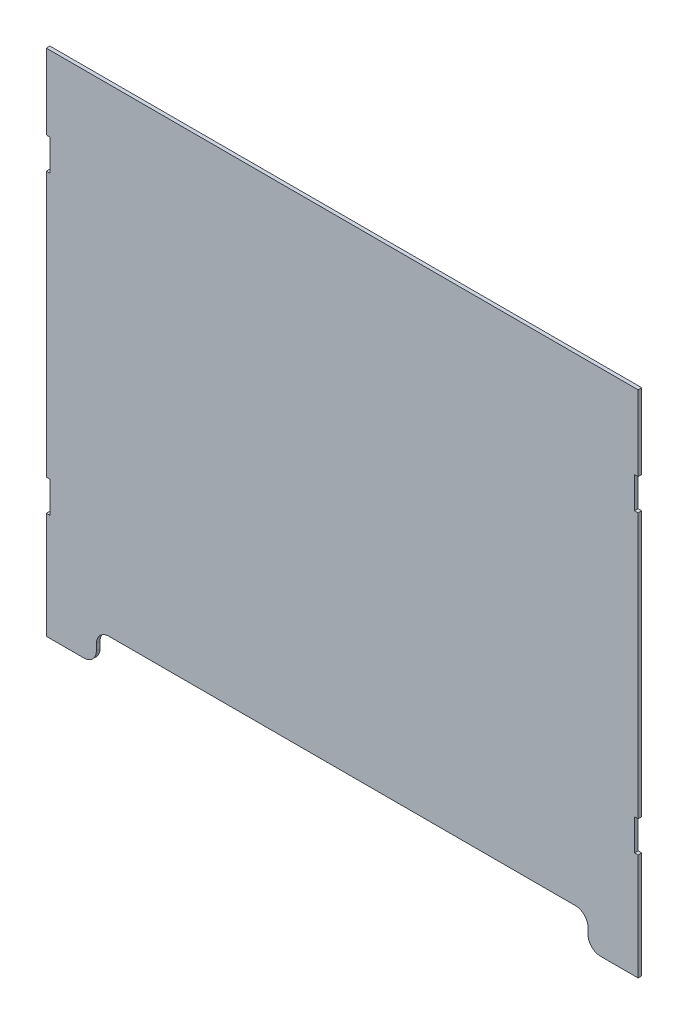
ISO-10303-21;
HEADER;
FILE_DESCRIPTION(('STEP AP214'),'2;1');
FILE_NAME('part.step','',(''),(''),'','','');
FILE_SCHEMA(('AUTOMOTIVE_DESIGN { 1 0 10303 214 1 1 1 1 }'));
ENDSEC;
DATA;
#1=APPLICATION_CONTEXT('core data for automotive mechanical design processes');
#2=APPLICATION_PROTOCOL_DEFINITION('international standard','automotive_design',2000,#1);
#3=PRODUCT_CONTEXT('',#1,'mechanical');
#4=PRODUCT('Part','Part','',(#3));
#5=PRODUCT_RELATED_PRODUCT_CATEGORY('part','',(#4));
#6=PRODUCT_DEFINITION_FORMATION('','',#4);
#7=PRODUCT_DEFINITION_CONTEXT('part definition',#1,'design');
#8=PRODUCT_DEFINITION('design','',#6,#7);
#9=PRODUCT_DEFINITION_SHAPE('','',#8);
#10=(LENGTH_UNIT() NAMED_UNIT(*) SI_UNIT(.MILLI.,.METRE.));
#11=(NAMED_UNIT(*) PLANE_ANGLE_UNIT() SI_UNIT($,.RADIAN.));
#12=(NAMED_UNIT(*) SI_UNIT($,.STERADIAN.) SOLID_ANGLE_UNIT());
#13=UNCERTAINTY_MEASURE_WITH_UNIT(LENGTH_MEASURE(1.E-05),#10,'distance_accuracy_value','');
#14=(GEOMETRIC_REPRESENTATION_CONTEXT(3) GLOBAL_UNCERTAINTY_ASSIGNED_CONTEXT((#13)) GLOBAL_UNIT_ASSIGNED_CONTEXT((#10,
#11,#12)) REPRESENTATION_CONTEXT('',''));
#15=CARTESIAN_POINT('',(0.,0.,0.));
#16=DIRECTION('',(0.,0.,1.));
#17=DIRECTION('',(1.,0.,0.));
#18=AXIS2_PLACEMENT_3D('',#15,#16,#17);
#19=CARTESIAN_POINT('',(236.1,143.2,2.9));
#20=DIRECTION('',(-1.,0.,0.));
#21=DIRECTION('',(0.,0.,1.));
#22=AXIS2_PLACEMENT_3D('',#19,#20,#21);
#23=PLANE('',#22);
#24=DIRECTION('',(0.,1.,0.));
#25=VECTOR('',#24,1.);
#26=CARTESIAN_POINT('',(236.1,143.2,0.));
#27=LINE('',#26,#25);
#28=CARTESIAN_POINT('',(236.1,143.2,0.));
#29=VERTEX_POINT('',#28);
#30=CARTESIAN_POINT('',(236.1,203.2,0.));
#31=VERTEX_POINT('',#30);
#32=EDGE_CURVE('E249',#29,#31,#27,.T.);
#33=ORIENTED_EDGE('',*,*,#32,.T.);
#34=DIRECTION('',(0.,0.,-1.));
#35=VECTOR('',#34,1.);
#36=CARTESIAN_POINT('',(236.1,203.2,2.9));
#37=LINE('',#36,#35);
#38=CARTESIAN_POINT('',(236.1,203.2,2.9));
#39=VERTEX_POINT('',#38);
#40=EDGE_CURVE('E11',#39,#31,#37,.T.);
#41=ORIENTED_EDGE('',*,*,#40,.F.);
#42=DIRECTION('',(0.,1.,0.));
#43=VECTOR('',#42,1.);
#44=CARTESIAN_POINT('',(236.1,143.2,2.9));
#45=LINE('',#44,#43);
#46=CARTESIAN_POINT('',(236.1,143.2,2.9));
#47=VERTEX_POINT('',#46);
#48=EDGE_CURVE('E303',#47,#39,#45,.T.);
#49=ORIENTED_EDGE('',*,*,#48,.F.);
#50=DIRECTION('',(0.,0.,-1.));
#51=VECTOR('',#50,1.);
#52=CARTESIAN_POINT('',(236.1,143.2,2.9));
#53=LINE('',#52,#51);
#54=EDGE_CURVE('E245',#47,#29,#53,.T.);
#55=ORIENTED_EDGE('',*,*,#54,.T.);
#56=EDGE_LOOP('',(#33,#41,#49,#55));
#57=FACE_BOUND('',#56,.T.);
#58=ADVANCED_FACE('F33',(#57),#23,.F.);
#59=CARTESIAN_POINT('',(-236.1,203.2,2.9));
#60=DIRECTION('',(0.,-1.,0.));
#61=DIRECTION('',(0.,0.,-1.));
#62=AXIS2_PLACEMENT_3D('',#59,#60,#61);
#63=PLANE('',#62);
#64=DIRECTION('',(-1.,0.,0.));
#65=VECTOR('',#64,1.);
#66=CARTESIAN_POINT('',(-236.1,203.2,0.));
#67=LINE('',#66,#65);
#68=CARTESIAN_POINT('',(-236.1,203.2,0.));
#69=VERTEX_POINT('',#68);
#70=EDGE_CURVE('E252',#31,#69,#67,.T.);
#71=ORIENTED_EDGE('',*,*,#70,.T.);
#72=DIRECTION('',(0.,0.,-1.));
#73=VECTOR('',#72,1.);
#74=CARTESIAN_POINT('',(-236.1,203.2,2.9));
#75=LINE('',#74,#73);
#76=CARTESIAN_POINT('',(-236.1,203.2,2.9));
#77=VERTEX_POINT('',#76);
#78=EDGE_CURVE('E41',#77,#69,#75,.T.);
#79=ORIENTED_EDGE('',*,*,#78,.F.);
#80=DIRECTION('',(-1.,0.,0.));
#81=VECTOR('',#80,1.);
#82=CARTESIAN_POINT('',(-236.1,203.2,2.9));
#83=LINE('',#82,#81);
#84=EDGE_CURVE('E152',#39,#77,#83,.T.);
#85=ORIENTED_EDGE('',*,*,#84,.F.);
#86=ORIENTED_EDGE('',*,*,#40,.T.);
#87=EDGE_LOOP('',(#71,#79,#85,#86));
#88=FACE_BOUND('',#87,.T.);
#89=ADVANCED_FACE('F461',(#88),#63,.F.);
#90=CARTESIAN_POINT('',(-236.1,143.2,2.9));
#91=DIRECTION('',(1.,0.,0.));
#92=DIRECTION('',(0.,0.,-1.));
#93=AXIS2_PLACEMENT_3D('',#90,#91,#92);
#94=PLANE('',#93);
#95=DIRECTION('',(0.,-1.,0.));
#96=VECTOR('',#95,1.);
#97=CARTESIAN_POINT('',(-236.1,143.2,0.));
#98=LINE('',#97,#96);
#99=CARTESIAN_POINT('',(-236.1,143.2,0.));
#100=VERTEX_POINT('',#99);
#101=EDGE_CURVE('E254',#69,#100,#98,.T.);
#102=ORIENTED_EDGE('',*,*,#101,.T.);
#103=DIRECTION('',(0.,0.,-1.));
#104=VECTOR('',#103,1.);
#105=CARTESIAN_POINT('',(-236.1,143.2,2.9));
#106=LINE('',#105,#104);
#107=CARTESIAN_POINT('',(-236.1,143.2,2.9));
#108=VERTEX_POINT('',#107);
#109=EDGE_CURVE('E370',#108,#100,#106,.T.);
#110=ORIENTED_EDGE('',*,*,#109,.F.);
#111=DIRECTION('',(0.,-1.,0.));
#112=VECTOR('',#111,1.);
#113=CARTESIAN_POINT('',(-236.1,143.2,2.9));
#114=LINE('',#113,#112);
#115=EDGE_CURVE('E378',#77,#108,#114,.T.);
#116=ORIENTED_EDGE('',*,*,#115,.F.);
#117=ORIENTED_EDGE('',*,*,#78,.T.);
#118=EDGE_LOOP('',(#102,#110,#116,#117));
#119=FACE_BOUND('',#118,.T.);
#120=ADVANCED_FACE('F376',(#119),#94,.F.);
#121=CARTESIAN_POINT('',(-236.1,143.2,2.9));
#122=DIRECTION('',(0.,1.,0.));
#123=DIRECTION('',(0.,0.,1.));
#124=AXIS2_PLACEMENT_3D('',#121,#122,#123);
#125=PLANE('',#124);
#126=DIRECTION('',(1.,0.,0.));
#127=VECTOR('',#126,1.);
#128=CARTESIAN_POINT('',(-236.1,143.2,0.));
#129=LINE('',#128,#127);
#130=CARTESIAN_POINT('',(-233.2,143.2,0.));
#131=VERTEX_POINT('',#130);
#132=EDGE_CURVE('E256',#100,#131,#129,.T.);
#133=ORIENTED_EDGE('',*,*,#132,.T.);
#134=DIRECTION('',(0.,0.,-1.));
#135=VECTOR('',#134,1.);
#136=CARTESIAN_POINT('',(-233.2,143.2,2.9));
#137=LINE('',#136,#135);
#138=CARTESIAN_POINT('',(-233.2,143.2,2.9));
#139=VERTEX_POINT('',#138);
#140=EDGE_CURVE('E367',#139,#131,#137,.T.);
#141=ORIENTED_EDGE('',*,*,#140,.F.);
#142=DIRECTION('',(1.,0.,0.));
#143=VECTOR('',#142,1.);
#144=CARTESIAN_POINT('',(-236.1,143.2,2.9));
#145=LINE('',#144,#143);
#146=EDGE_CURVE('E396',#108,#139,#145,.T.);
#147=ORIENTED_EDGE('',*,*,#146,.F.);
#148=ORIENTED_EDGE('',*,*,#109,.T.);
#149=EDGE_LOOP('',(#133,#141,#147,#148));
#150=FACE_BOUND('',#149,.T.);
#151=ADVANCED_FACE('F387',(#150),#125,.F.);
#152=CARTESIAN_POINT('',(-233.2,143.2,2.9));
#153=DIRECTION('',(1.,0.,0.));
#154=DIRECTION('',(0.,0.,-1.));
#155=AXIS2_PLACEMENT_3D('',#152,#153,#154);
#156=PLANE('',#155);
#157=DIRECTION('',(0.,-1.,0.));
#158=VECTOR('',#157,1.);
#159=CARTESIAN_POINT('',(-233.2,143.2,0.));
#160=LINE('',#159,#158);
#161=CARTESIAN_POINT('',(-233.2,118.2,0.));
#162=VERTEX_POINT('',#161);
#163=EDGE_CURVE('E258',#131,#162,#160,.T.);
#164=ORIENTED_EDGE('',*,*,#163,.T.);
#165=DIRECTION('',(0.,0.,-1.));
#166=VECTOR('',#165,1.);
#167=CARTESIAN_POINT('',(-233.2,118.2,2.9));
#168=LINE('',#167,#166);
#169=CARTESIAN_POINT('',(-233.2,118.2,2.9));
#170=VERTEX_POINT('',#169);
#171=EDGE_CURVE('E364',#170,#162,#168,.T.);
#172=ORIENTED_EDGE('',*,*,#171,.F.);
#173=DIRECTION('',(0.,-1.,0.));
#174=VECTOR('',#173,1.);
#175=CARTESIAN_POINT('',(-233.2,143.2,2.9));
#176=LINE('',#175,#174);
#177=EDGE_CURVE('E393',#139,#170,#176,.T.);
#178=ORIENTED_EDGE('',*,*,#177,.F.);
#179=ORIENTED_EDGE('',*,*,#140,.T.);
#180=EDGE_LOOP('',(#164,#172,#178,#179));
#181=FACE_BOUND('',#180,.T.);
#182=ADVANCED_FACE('F391',(#181),#156,.F.);
#183=CARTESIAN_POINT('',(-236.1,118.2,2.9));
#184=DIRECTION('',(0.,-1.,0.));
#185=DIRECTION('',(0.,0.,-1.));
#186=AXIS2_PLACEMENT_3D('',#183,#184,#185);
#187=PLANE('',#186);
#188=DIRECTION('',(-1.,0.,0.));
#189=VECTOR('',#188,1.);
#190=CARTESIAN_POINT('',(-236.1,118.2,0.));
#191=LINE('',#190,#189);
#192=CARTESIAN_POINT('',(-236.1,118.2,0.));
#193=VERTEX_POINT('',#192);
#194=EDGE_CURVE('E260',#162,#193,#191,.T.);
#195=ORIENTED_EDGE('',*,*,#194,.T.);
#196=DIRECTION('',(0.,0.,-1.));
#197=VECTOR('',#196,1.);
#198=CARTESIAN_POINT('',(-236.1,118.2,2.9));
#199=LINE('',#198,#197);
#200=CARTESIAN_POINT('',(-236.1,118.2,2.9));
#201=VERTEX_POINT('',#200);
#202=EDGE_CURVE('E361',#201,#193,#199,.T.);
#203=ORIENTED_EDGE('',*,*,#202,.F.);
#204=DIRECTION('',(-1.,0.,0.));
#205=VECTOR('',#204,1.);
#206=CARTESIAN_POINT('',(-236.1,118.2,2.9));
#207=LINE('',#206,#205);
#208=EDGE_CURVE('E395',#170,#201,#207,.T.);
#209=ORIENTED_EDGE('',*,*,#208,.F.);
#210=ORIENTED_EDGE('',*,*,#171,.T.);
#211=EDGE_LOOP('',(#195,#203,#209,#210));
#212=FACE_BOUND('',#211,.T.);
#213=ADVANCED_FACE('F474',(#212),#187,.F.);
#214=CARTESIAN_POINT('',(-236.1,-93.1999999999998,2.9));
#215=DIRECTION('',(1.,0.,0.));
#216=DIRECTION('',(0.,0.,-1.));
#217=AXIS2_PLACEMENT_3D('',#214,#215,#216);
#218=PLANE('',#217);
#219=DIRECTION('',(0.,-1.,0.));
#220=VECTOR('',#219,1.);
#221=CARTESIAN_POINT('',(-236.1,-93.1999999999998,0.));
#222=LINE('',#221,#220);
#223=CARTESIAN_POINT('',(-236.1,-93.1999999999998,0.));
#224=VERTEX_POINT('',#223);
#225=EDGE_CURVE('E262',#193,#224,#222,.T.);
#226=ORIENTED_EDGE('',*,*,#225,.T.);
#227=DIRECTION('',(0.,0.,-1.));
#228=VECTOR('',#227,1.);
#229=CARTESIAN_POINT('',(-236.1,-93.1999999999998,2.9));
#230=LINE('',#229,#228);
#231=CARTESIAN_POINT('',(-236.1,-93.1999999999998,2.9));
#232=VERTEX_POINT('',#231);
#233=EDGE_CURVE('E358',#232,#224,#230,.T.);
#234=ORIENTED_EDGE('',*,*,#233,.F.);
#235=DIRECTION('',(0.,-1.,0.));
#236=VECTOR('',#235,1.);
#237=CARTESIAN_POINT('',(-236.1,-93.1999999999998,2.9));
#238=LINE('',#237,#236);
#239=EDGE_CURVE('E398',#201,#232,#238,.T.);
#240=ORIENTED_EDGE('',*,*,#239,.F.);
#241=ORIENTED_EDGE('',*,*,#202,.T.);
#242=EDGE_LOOP('',(#226,#234,#240,#241));
#243=FACE_BOUND('',#242,.T.);
#244=ADVANCED_FACE('F477',(#243),#218,.F.);
#245=CARTESIAN_POINT('',(-236.1,-93.1999999999998,2.9));
#246=DIRECTION('',(0.,1.,0.));
#247=DIRECTION('',(0.,0.,1.));
#248=AXIS2_PLACEMENT_3D('',#245,#246,#247);
#249=PLANE('',#248);
#250=DIRECTION('',(1.,0.,0.));
#251=VECTOR('',#250,1.);
#252=CARTESIAN_POINT('',(-236.1,-93.1999999999998,0.));
#253=LINE('',#252,#251);
#254=CARTESIAN_POINT('',(-233.2,-93.1999999999998,0.));
#255=VERTEX_POINT('',#254);
#256=EDGE_CURVE('E264',#224,#255,#253,.T.);
#257=ORIENTED_EDGE('',*,*,#256,.T.);
#258=DIRECTION('',(0.,0.,-1.));
#259=VECTOR('',#258,1.);
#260=CARTESIAN_POINT('',(-233.2,-93.1999999999998,2.9));
#261=LINE('',#260,#259);
#262=CARTESIAN_POINT('',(-233.2,-93.1999999999998,2.9));
#263=VERTEX_POINT('',#262);
#264=EDGE_CURVE('E355',#263,#255,#261,.T.);
#265=ORIENTED_EDGE('',*,*,#264,.F.);
#266=DIRECTION('',(1.,0.,0.));
#267=VECTOR('',#266,1.);
#268=CARTESIAN_POINT('',(-236.1,-93.1999999999998,2.9));
#269=LINE('',#268,#267);
#270=EDGE_CURVE('E404',#232,#263,#269,.T.);
#271=ORIENTED_EDGE('',*,*,#270,.F.);
#272=ORIENTED_EDGE('',*,*,#233,.T.);
#273=EDGE_LOOP('',(#257,#265,#271,#272));
#274=FACE_BOUND('',#273,.T.);
#275=ADVANCED_FACE('F481',(#274),#249,.F.);
#276=CARTESIAN_POINT('',(-233.2,-93.1999999999998,2.9));
#277=DIRECTION('',(1.,0.,0.));
#278=DIRECTION('',(0.,0.,-1.));
#279=AXIS2_PLACEMENT_3D('',#276,#277,#278);
#280=PLANE('',#279);
#281=DIRECTION('',(0.,-1.,0.));
#282=VECTOR('',#281,1.);
#283=CARTESIAN_POINT('',(-233.2,-93.1999999999998,0.));
#284=LINE('',#283,#282);
#285=CARTESIAN_POINT('',(-233.2,-118.2,0.));
#286=VERTEX_POINT('',#285);
#287=EDGE_CURVE('E266',#255,#286,#284,.T.);
#288=ORIENTED_EDGE('',*,*,#287,.T.);
#289=DIRECTION('',(0.,0.,-1.));
#290=VECTOR('',#289,1.);
#291=CARTESIAN_POINT('',(-233.2,-118.2,2.9));
#292=LINE('',#291,#290);
#293=CARTESIAN_POINT('',(-233.2,-118.2,2.9));
#294=VERTEX_POINT('',#293);
#295=EDGE_CURVE('E352',#294,#286,#292,.T.);
#296=ORIENTED_EDGE('',*,*,#295,.F.);
#297=DIRECTION('',(0.,-1.,0.));
#298=VECTOR('',#297,1.);
#299=CARTESIAN_POINT('',(-233.2,-93.1999999999998,2.9));
#300=LINE('',#299,#298);
#301=EDGE_CURVE('E406',#263,#294,#300,.T.);
#302=ORIENTED_EDGE('',*,*,#301,.F.);
#303=ORIENTED_EDGE('',*,*,#264,.T.);
#304=EDGE_LOOP('',(#288,#296,#302,#303));
#305=FACE_BOUND('',#304,.T.);
#306=ADVANCED_FACE('F485',(#305),#280,.F.);
#307=CARTESIAN_POINT('',(-236.1,-118.2,2.9));
#308=DIRECTION('',(0.,-1.,0.));
#309=DIRECTION('',(0.,0.,-1.));
#310=AXIS2_PLACEMENT_3D('',#307,#308,#309);
#311=PLANE('',#310);
#312=DIRECTION('',(-1.,0.,0.));
#313=VECTOR('',#312,1.);
#314=CARTESIAN_POINT('',(-236.1,-118.2,0.));
#315=LINE('',#314,#313);
#316=CARTESIAN_POINT('',(-236.1,-118.2,0.));
#317=VERTEX_POINT('',#316);
#318=EDGE_CURVE('E268',#286,#317,#315,.T.);
#319=ORIENTED_EDGE('',*,*,#318,.T.);
#320=DIRECTION('',(0.,0.,-1.));
#321=VECTOR('',#320,1.);
#322=CARTESIAN_POINT('',(-236.1,-118.2,2.9));
#323=LINE('',#322,#321);
#324=CARTESIAN_POINT('',(-236.1,-118.2,2.9));
#325=VERTEX_POINT('',#324);
#326=EDGE_CURVE('E349',#325,#317,#323,.T.);
#327=ORIENTED_EDGE('',*,*,#326,.F.);
#328=DIRECTION('',(-1.,0.,0.));
#329=VECTOR('',#328,1.);
#330=CARTESIAN_POINT('',(-236.1,-118.2,2.9));
#331=LINE('',#330,#329);
#332=EDGE_CURVE('E408',#294,#325,#331,.T.);
#333=ORIENTED_EDGE('',*,*,#332,.F.);
#334=ORIENTED_EDGE('',*,*,#295,.T.);
#335=EDGE_LOOP('',(#319,#327,#333,#334));
#336=FACE_BOUND('',#335,.T.);
#337=ADVANCED_FACE('F489',(#336),#311,.F.);
#338=CARTESIAN_POINT('',(-236.1,-203.2,2.9));
#339=DIRECTION('',(1.,0.,0.));
#340=DIRECTION('',(0.,0.,-1.));
#341=AXIS2_PLACEMENT_3D('',#338,#339,#340);
#342=PLANE('',#341);
#343=DIRECTION('',(0.,-1.,0.));
#344=VECTOR('',#343,1.);
#345=CARTESIAN_POINT('',(-236.1,-203.2,0.));
#346=LINE('',#345,#344);
#347=CARTESIAN_POINT('',(-236.1,-203.2,0.));
#348=VERTEX_POINT('',#347);
#349=EDGE_CURVE('E270',#317,#348,#346,.T.);
#350=ORIENTED_EDGE('',*,*,#349,.T.);
#351=DIRECTION('',(0.,0.,-1.));
#352=VECTOR('',#351,1.);
#353=CARTESIAN_POINT('',(-236.1,-203.2,2.9));
#354=LINE('',#353,#352);
#355=CARTESIAN_POINT('',(-236.1,-203.2,2.9));
#356=VERTEX_POINT('',#355);
#357=EDGE_CURVE('E346',#356,#348,#354,.T.);
#358=ORIENTED_EDGE('',*,*,#357,.F.);
#359=DIRECTION('',(0.,-1.,0.));
#360=VECTOR('',#359,1.);
#361=CARTESIAN_POINT('',(-236.1,-203.2,2.9));
#362=LINE('',#361,#360);
#363=EDGE_CURVE('E410',#325,#356,#362,.T.);
#364=ORIENTED_EDGE('',*,*,#363,.F.);
#365=ORIENTED_EDGE('',*,*,#326,.T.);
#366=EDGE_LOOP('',(#350,#358,#364,#365));
#367=FACE_BOUND('',#366,.T.);
#368=ADVANCED_FACE('F493',(#367),#342,.F.);
#369=CARTESIAN_POINT('',(-236.1,-203.2,2.9));
#370=DIRECTION('',(0.,1.,0.));
#371=DIRECTION('',(0.,0.,1.));
#372=AXIS2_PLACEMENT_3D('',#369,#370,#371);
#373=PLANE('',#372);
#374=DIRECTION('',(1.,0.,0.));
#375=VECTOR('',#374,1.);
#376=CARTESIAN_POINT('',(-236.1,-203.2,0.));
#377=LINE('',#376,#375);
#378=CARTESIAN_POINT('',(-206.1,-203.2,0.));
#379=VERTEX_POINT('',#378);
#380=EDGE_CURVE('E272',#348,#379,#377,.T.);
#381=ORIENTED_EDGE('',*,*,#380,.T.);
#382=DIRECTION('',(0.,0.,-1.));
#383=VECTOR('',#382,1.);
#384=CARTESIAN_POINT('',(-206.1,-203.2,2.9));
#385=LINE('',#384,#383);
#386=CARTESIAN_POINT('',(-206.1,-203.2,2.9));
#387=VERTEX_POINT('',#386);
#388=EDGE_CURVE('E343',#387,#379,#385,.T.);
#389=ORIENTED_EDGE('',*,*,#388,.F.);
#390=DIRECTION('',(1.,0.,0.));
#391=VECTOR('',#390,1.);
#392=CARTESIAN_POINT('',(-236.1,-203.2,2.9));
#393=LINE('',#392,#391);
#394=EDGE_CURVE('E412',#356,#387,#393,.T.);
#395=ORIENTED_EDGE('',*,*,#394,.F.);
#396=ORIENTED_EDGE('',*,*,#357,.T.);
#397=EDGE_LOOP('',(#381,#389,#395,#396));
#398=FACE_BOUND('',#397,.T.);
#399=ADVANCED_FACE('F497',(#398),#373,.F.);
#400=CARTESIAN_POINT('',(-206.1,-193.2,2.9));
#401=DIRECTION('',(0.,0.,-1.));
#402=DIRECTION('',(-1.,0.,0.));
#403=AXIS2_PLACEMENT_3D('',#400,#401,#402);
#404=CYLINDRICAL_SURFACE('',#403,10.);
#405=CARTESIAN_POINT('',(-206.1,-193.2,0.));
#406=DIRECTION('',(0.,0.,1.));
#407=DIRECTION('',(1.,0.,0.));
#408=AXIS2_PLACEMENT_3D('',#405,#406,#407);
#409=CIRCLE('',#408,10.);
#410=CARTESIAN_POINT('',(-196.1,-193.2,0.));
#411=VERTEX_POINT('',#410);
#412=EDGE_CURVE('E274',#379,#411,#409,.T.);
#413=ORIENTED_EDGE('',*,*,#412,.T.);
#414=DIRECTION('',(0.,0.,-1.));
#415=VECTOR('',#414,1.);
#416=CARTESIAN_POINT('',(-196.1,-193.2,2.9));
#417=LINE('',#416,#415);
#418=CARTESIAN_POINT('',(-196.1,-193.2,2.9));
#419=VERTEX_POINT('',#418);
#420=EDGE_CURVE('E340',#419,#411,#417,.T.);
#421=ORIENTED_EDGE('',*,*,#420,.F.);
#422=CARTESIAN_POINT('',(-206.1,-193.2,2.9));
#423=DIRECTION('',(0.,0.,1.));
#424=DIRECTION('',(1.,0.,0.));
#425=AXIS2_PLACEMENT_3D('',#422,#423,#424);
#426=CIRCLE('',#425,10.);
#427=EDGE_CURVE('E414',#387,#419,#426,.T.);
#428=ORIENTED_EDGE('',*,*,#427,.F.);
#429=ORIENTED_EDGE('',*,*,#388,.T.);
#430=EDGE_LOOP('',(#413,#421,#428,#429));
#431=FACE_BOUND('',#430,.T.);
#432=ADVANCED_FACE('F501',(#431),#404,.T.);
#433=CARTESIAN_POINT('',(-196.1,-193.2,2.9));
#434=DIRECTION('',(-1.,0.,0.));
#435=DIRECTION('',(0.,0.,1.));
#436=AXIS2_PLACEMENT_3D('',#433,#434,#435);
#437=PLANE('',#436);
#438=DIRECTION('',(0.,1.,0.));
#439=VECTOR('',#438,1.);
#440=CARTESIAN_POINT('',(-196.1,-193.2,0.));
#441=LINE('',#440,#439);
#442=CARTESIAN_POINT('',(-196.1,-188.2,0.));
#443=VERTEX_POINT('',#442);
#444=EDGE_CURVE('E276',#411,#443,#441,.T.);
#445=ORIENTED_EDGE('',*,*,#444,.T.);
#446=DIRECTION('',(0.,0.,-1.));
#447=VECTOR('',#446,1.);
#448=CARTESIAN_POINT('',(-196.1,-188.2,2.9));
#449=LINE('',#448,#447);
#450=CARTESIAN_POINT('',(-196.1,-188.2,2.9));
#451=VERTEX_POINT('',#450);
#452=EDGE_CURVE('E337',#451,#443,#449,.T.);
#453=ORIENTED_EDGE('',*,*,#452,.F.);
#454=DIRECTION('',(0.,1.,0.));
#455=VECTOR('',#454,1.);
#456=CARTESIAN_POINT('',(-196.1,-193.2,2.9));
#457=LINE('',#456,#455);
#458=EDGE_CURVE('E416',#419,#451,#457,.T.);
#459=ORIENTED_EDGE('',*,*,#458,.F.);
#460=ORIENTED_EDGE('',*,*,#420,.T.);
#461=EDGE_LOOP('',(#445,#453,#459,#460));
#462=FACE_BOUND('',#461,.T.);
#463=ADVANCED_FACE('F505',(#462),#437,.F.);
#464=CARTESIAN_POINT('',(-186.1,-188.2,2.9));
#465=DIRECTION('',(0.,0.,-1.));
#466=DIRECTION('',(-1.,0.,0.));
#467=AXIS2_PLACEMENT_3D('',#464,#465,#466);
#468=CYLINDRICAL_SURFACE('',#467,10.);
#469=CARTESIAN_POINT('',(-186.1,-188.2,0.));
#470=DIRECTION('',(0.,0.,-1.));
#471=DIRECTION('',(-1.,0.,0.));
#472=AXIS2_PLACEMENT_3D('',#469,#470,#471);
#473=CIRCLE('',#472,10.);
#474=CARTESIAN_POINT('',(-186.1,-178.2,0.));
#475=VERTEX_POINT('',#474);
#476=EDGE_CURVE('E278',#443,#475,#473,.T.);
#477=ORIENTED_EDGE('',*,*,#476,.T.);
#478=DIRECTION('',(0.,0.,-1.));
#479=VECTOR('',#478,1.);
#480=CARTESIAN_POINT('',(-186.1,-178.2,2.9));
#481=LINE('',#480,#479);
#482=CARTESIAN_POINT('',(-186.1,-178.2,2.9));
#483=VERTEX_POINT('',#482);
#484=EDGE_CURVE('E334',#483,#475,#481,.T.);
#485=ORIENTED_EDGE('',*,*,#484,.F.);
#486=CARTESIAN_POINT('',(-186.1,-188.2,2.9));
#487=DIRECTION('',(0.,0.,-1.));
#488=DIRECTION('',(-1.,0.,0.));
#489=AXIS2_PLACEMENT_3D('',#486,#487,#488);
#490=CIRCLE('',#489,10.);
#491=EDGE_CURVE('E418',#451,#483,#490,.T.);
#492=ORIENTED_EDGE('',*,*,#491,.F.);
#493=ORIENTED_EDGE('',*,*,#452,.T.);
#494=EDGE_LOOP('',(#477,#485,#492,#493));
#495=FACE_BOUND('',#494,.T.);
#496=ADVANCED_FACE('F509',(#495),#468,.F.);
#497=CARTESIAN_POINT('',(-186.1,-178.2,2.9));
#498=DIRECTION('',(0.,1.,0.));
#499=DIRECTION('',(0.,0.,1.));
#500=AXIS2_PLACEMENT_3D('',#497,#498,#499);
#501=PLANE('',#500);
#502=DIRECTION('',(1.,0.,0.));
#503=VECTOR('',#502,1.);
#504=CARTESIAN_POINT('',(-186.1,-178.2,0.));
#505=LINE('',#504,#503);
#506=CARTESIAN_POINT('',(186.1,-178.2,0.));
#507=VERTEX_POINT('',#506);
#508=EDGE_CURVE('E280',#475,#507,#505,.T.);
#509=ORIENTED_EDGE('',*,*,#508,.T.);
#510=DIRECTION('',(0.,0.,-1.));
#511=VECTOR('',#510,1.);
#512=CARTESIAN_POINT('',(186.1,-178.2,2.9));
#513=LINE('',#512,#511);
#514=CARTESIAN_POINT('',(186.1,-178.2,2.9));
#515=VERTEX_POINT('',#514);
#516=EDGE_CURVE('E331',#515,#507,#513,.T.);
#517=ORIENTED_EDGE('',*,*,#516,.F.);
#518=DIRECTION('',(1.,0.,0.));
#519=VECTOR('',#518,1.);
#520=CARTESIAN_POINT('',(-186.1,-178.2,2.9));
#521=LINE('',#520,#519);
#522=EDGE_CURVE('E420',#483,#515,#521,.T.);
#523=ORIENTED_EDGE('',*,*,#522,.F.);
#524=ORIENTED_EDGE('',*,*,#484,.T.);
#525=EDGE_LOOP('',(#509,#517,#523,#524));
#526=FACE_BOUND('',#525,.T.);
#527=ADVANCED_FACE('F513',(#526),#501,.F.);
#528=CARTESIAN_POINT('',(186.1,-188.2,2.9));
#529=DIRECTION('',(0.,0.,-1.));
#530=DIRECTION('',(-1.,0.,0.));
#531=AXIS2_PLACEMENT_3D('',#528,#529,#530);
#532=CYLINDRICAL_SURFACE('',#531,10.);
#533=CARTESIAN_POINT('',(186.1,-188.2,0.));
#534=DIRECTION('',(0.,0.,-1.));
#535=DIRECTION('',(-1.,0.,0.));
#536=AXIS2_PLACEMENT_3D('',#533,#534,#535);
#537=CIRCLE('',#536,10.);
#538=CARTESIAN_POINT('',(196.1,-188.2,0.));
#539=VERTEX_POINT('',#538);
#540=EDGE_CURVE('E282',#507,#539,#537,.T.);
#541=ORIENTED_EDGE('',*,*,#540,.T.);
#542=DIRECTION('',(0.,0.,-1.));
#543=VECTOR('',#542,1.);
#544=CARTESIAN_POINT('',(196.1,-188.2,2.9));
#545=LINE('',#544,#543);
#546=CARTESIAN_POINT('',(196.1,-188.2,2.9));
#547=VERTEX_POINT('',#546);
#548=EDGE_CURVE('E328',#547,#539,#545,.T.);
#549=ORIENTED_EDGE('',*,*,#548,.F.);
#550=CARTESIAN_POINT('',(186.1,-188.2,2.9));
#551=DIRECTION('',(0.,0.,-1.));
#552=DIRECTION('',(-1.,0.,0.));
#553=AXIS2_PLACEMENT_3D('',#550,#551,#552);
#554=CIRCLE('',#553,10.);
#555=EDGE_CURVE('E422',#515,#547,#554,.T.);
#556=ORIENTED_EDGE('',*,*,#555,.F.);
#557=ORIENTED_EDGE('',*,*,#516,.T.);
#558=EDGE_LOOP('',(#541,#549,#556,#557));
#559=FACE_BOUND('',#558,.T.);
#560=ADVANCED_FACE('F517',(#559),#532,.F.);
#561=CARTESIAN_POINT('',(196.1,-193.2,2.9));
#562=DIRECTION('',(1.,0.,0.));
#563=DIRECTION('',(0.,0.,-1.));
#564=AXIS2_PLACEMENT_3D('',#561,#562,#563);
#565=PLANE('',#564);
#566=DIRECTION('',(0.,-1.,0.));
#567=VECTOR('',#566,1.);
#568=CARTESIAN_POINT('',(196.1,-193.2,0.));
#569=LINE('',#568,#567);
#570=CARTESIAN_POINT('',(196.1,-193.2,0.));
#571=VERTEX_POINT('',#570);
#572=EDGE_CURVE('E284',#539,#571,#569,.T.);
#573=ORIENTED_EDGE('',*,*,#572,.T.);
#574=DIRECTION('',(0.,0.,-1.));
#575=VECTOR('',#574,1.);
#576=CARTESIAN_POINT('',(196.1,-193.2,2.9));
#577=LINE('',#576,#575);
#578=CARTESIAN_POINT('',(196.1,-193.2,2.9));
#579=VERTEX_POINT('',#578);
#580=EDGE_CURVE('E325',#579,#571,#577,.T.);
#581=ORIENTED_EDGE('',*,*,#580,.F.);
#582=DIRECTION('',(0.,-1.,0.));
#583=VECTOR('',#582,1.);
#584=CARTESIAN_POINT('',(196.1,-193.2,2.9));
#585=LINE('',#584,#583);
#586=EDGE_CURVE('E424',#547,#579,#585,.T.);
#587=ORIENTED_EDGE('',*,*,#586,.F.);
#588=ORIENTED_EDGE('',*,*,#548,.T.);
#589=EDGE_LOOP('',(#573,#581,#587,#588));
#590=FACE_BOUND('',#589,.T.);
#591=ADVANCED_FACE('F521',(#590),#565,.F.);
#592=CARTESIAN_POINT('',(206.1,-193.2,2.9));
#593=DIRECTION('',(0.,0.,-1.));
#594=DIRECTION('',(-1.,0.,0.));
#595=AXIS2_PLACEMENT_3D('',#592,#593,#594);
#596=CYLINDRICAL_SURFACE('',#595,10.);
#597=CARTESIAN_POINT('',(206.1,-193.2,0.));
#598=DIRECTION('',(0.,0.,1.));
#599=DIRECTION('',(-1.,0.,0.));
#600=AXIS2_PLACEMENT_3D('',#597,#598,#599);
#601=CIRCLE('',#600,10.);
#602=CARTESIAN_POINT('',(206.1,-203.2,0.));
#603=VERTEX_POINT('',#602);
#604=EDGE_CURVE('E286',#571,#603,#601,.T.);
#605=ORIENTED_EDGE('',*,*,#604,.T.);
#606=DIRECTION('',(0.,0.,-1.));
#607=VECTOR('',#606,1.);
#608=CARTESIAN_POINT('',(206.1,-203.2,2.9));
#609=LINE('',#608,#607);
#610=CARTESIAN_POINT('',(206.1,-203.2,2.9));
#611=VERTEX_POINT('',#610);
#612=EDGE_CURVE('E322',#611,#603,#609,.T.);
#613=ORIENTED_EDGE('',*,*,#612,.F.);
#614=CARTESIAN_POINT('',(206.1,-193.2,2.9));
#615=DIRECTION('',(0.,0.,1.));
#616=DIRECTION('',(-1.,0.,0.));
#617=AXIS2_PLACEMENT_3D('',#614,#615,#616);
#618=CIRCLE('',#617,10.);
#619=EDGE_CURVE('E426',#579,#611,#618,.T.);
#620=ORIENTED_EDGE('',*,*,#619,.F.);
#621=ORIENTED_EDGE('',*,*,#580,.T.);
#622=EDGE_LOOP('',(#605,#613,#620,#621));
#623=FACE_BOUND('',#622,.T.);
#624=ADVANCED_FACE('F525',(#623),#596,.T.);
#625=CARTESIAN_POINT('',(206.1,-203.2,2.9));
#626=DIRECTION('',(0.,1.,0.));
#627=DIRECTION('',(0.,0.,1.));
#628=AXIS2_PLACEMENT_3D('',#625,#626,#627);
#629=PLANE('',#628);
#630=DIRECTION('',(1.,0.,0.));
#631=VECTOR('',#630,1.);
#632=CARTESIAN_POINT('',(206.1,-203.2,0.));
#633=LINE('',#632,#631);
#634=CARTESIAN_POINT('',(236.1,-203.2,0.));
#635=VERTEX_POINT('',#634);
#636=EDGE_CURVE('E288',#603,#635,#633,.T.);
#637=ORIENTED_EDGE('',*,*,#636,.T.);
#638=DIRECTION('',(0.,0.,-1.));
#639=VECTOR('',#638,1.);
#640=CARTESIAN_POINT('',(236.1,-203.2,2.9));
#641=LINE('',#640,#639);
#642=CARTESIAN_POINT('',(236.1,-203.2,2.9));
#643=VERTEX_POINT('',#642);
#644=EDGE_CURVE('E319',#643,#635,#641,.T.);
#645=ORIENTED_EDGE('',*,*,#644,.F.);
#646=DIRECTION('',(1.,0.,0.));
#647=VECTOR('',#646,1.);
#648=CARTESIAN_POINT('',(206.1,-203.2,2.9));
#649=LINE('',#648,#647);
#650=EDGE_CURVE('E428',#611,#643,#649,.T.);
#651=ORIENTED_EDGE('',*,*,#650,.F.);
#652=ORIENTED_EDGE('',*,*,#612,.T.);
#653=EDGE_LOOP('',(#637,#645,#651,#652));
#654=FACE_BOUND('',#653,.T.);
#655=ADVANCED_FACE('F529',(#654),#629,.F.);
#656=CARTESIAN_POINT('',(236.1,-203.2,2.9));
#657=DIRECTION('',(-1.,0.,0.));
#658=DIRECTION('',(0.,0.,1.));
#659=AXIS2_PLACEMENT_3D('',#656,#657,#658);
#660=PLANE('',#659);
#661=DIRECTION('',(0.,1.,0.));
#662=VECTOR('',#661,1.);
#663=CARTESIAN_POINT('',(236.1,-203.2,0.));
#664=LINE('',#663,#662);
#665=CARTESIAN_POINT('',(236.1,-118.2,0.));
#666=VERTEX_POINT('',#665);
#667=EDGE_CURVE('E290',#635,#666,#664,.T.);
#668=ORIENTED_EDGE('',*,*,#667,.T.);
#669=DIRECTION('',(0.,0.,-1.));
#670=VECTOR('',#669,1.);
#671=CARTESIAN_POINT('',(236.1,-118.2,2.9));
#672=LINE('',#671,#670);
#673=CARTESIAN_POINT('',(236.1,-118.2,2.9));
#674=VERTEX_POINT('',#673);
#675=EDGE_CURVE('E316',#674,#666,#672,.T.);
#676=ORIENTED_EDGE('',*,*,#675,.F.);
#677=DIRECTION('',(0.,1.,0.));
#678=VECTOR('',#677,1.);
#679=CARTESIAN_POINT('',(236.1,-203.2,2.9));
#680=LINE('',#679,#678);
#681=EDGE_CURVE('E430',#643,#674,#680,.T.);
#682=ORIENTED_EDGE('',*,*,#681,.F.);
#683=ORIENTED_EDGE('',*,*,#644,.T.);
#684=EDGE_LOOP('',(#668,#676,#682,#683));
#685=FACE_BOUND('',#684,.T.);
#686=ADVANCED_FACE('F533',(#685),#660,.F.);
#687=CARTESIAN_POINT('',(236.1,-118.2,2.9));
#688=DIRECTION('',(0.,-1.,0.));
#689=DIRECTION('',(0.,0.,-1.));
#690=AXIS2_PLACEMENT_3D('',#687,#688,#689);
#691=PLANE('',#690);
#692=DIRECTION('',(-1.,0.,0.));
#693=VECTOR('',#692,1.);
#694=CARTESIAN_POINT('',(236.1,-118.2,0.));
#695=LINE('',#694,#693);
#696=CARTESIAN_POINT('',(233.2,-118.2,0.));
#697=VERTEX_POINT('',#696);
#698=EDGE_CURVE('E292',#666,#697,#695,.T.);
#699=ORIENTED_EDGE('',*,*,#698,.T.);
#700=DIRECTION('',(0.,0.,-1.));
#701=VECTOR('',#700,1.);
#702=CARTESIAN_POINT('',(233.2,-118.2,2.9));
#703=LINE('',#702,#701);
#704=CARTESIAN_POINT('',(233.2,-118.2,2.9));
#705=VERTEX_POINT('',#704);
#706=EDGE_CURVE('E313',#705,#697,#703,.T.);
#707=ORIENTED_EDGE('',*,*,#706,.F.);
#708=DIRECTION('',(-1.,0.,0.));
#709=VECTOR('',#708,1.);
#710=CARTESIAN_POINT('',(236.1,-118.2,2.9));
#711=LINE('',#710,#709);
#712=EDGE_CURVE('E432',#674,#705,#711,.T.);
#713=ORIENTED_EDGE('',*,*,#712,.F.);
#714=ORIENTED_EDGE('',*,*,#675,.T.);
#715=EDGE_LOOP('',(#699,#707,#713,#714));
#716=FACE_BOUND('',#715,.T.);
#717=ADVANCED_FACE('F537',(#716),#691,.F.);
#718=CARTESIAN_POINT('',(233.2,-93.1999999999998,2.9));
#719=DIRECTION('',(-1.,0.,0.));
#720=DIRECTION('',(0.,0.,1.));
#721=AXIS2_PLACEMENT_3D('',#718,#719,#720);
#722=PLANE('',#721);
#723=DIRECTION('',(0.,1.,0.));
#724=VECTOR('',#723,1.);
#725=CARTESIAN_POINT('',(233.2,-93.1999999999998,0.));
#726=LINE('',#725,#724);
#727=CARTESIAN_POINT('',(233.2,-93.1999999999998,0.));
#728=VERTEX_POINT('',#727);
#729=EDGE_CURVE('E294',#697,#728,#726,.T.);
#730=ORIENTED_EDGE('',*,*,#729,.T.);
#731=DIRECTION('',(0.,0.,-1.));
#732=VECTOR('',#731,1.);
#733=CARTESIAN_POINT('',(233.2,-93.1999999999998,2.9));
#734=LINE('',#733,#732);
#735=CARTESIAN_POINT('',(233.2,-93.1999999999998,2.9));
#736=VERTEX_POINT('',#735);
#737=EDGE_CURVE('E310',#736,#728,#734,.T.);
#738=ORIENTED_EDGE('',*,*,#737,.F.);
#739=DIRECTION('',(0.,1.,0.));
#740=VECTOR('',#739,1.);
#741=CARTESIAN_POINT('',(233.2,-93.1999999999998,2.9));
#742=LINE('',#741,#740);
#743=EDGE_CURVE('E434',#705,#736,#742,.T.);
#744=ORIENTED_EDGE('',*,*,#743,.F.);
#745=ORIENTED_EDGE('',*,*,#706,.T.);
#746=EDGE_LOOP('',(#730,#738,#744,#745));
#747=FACE_BOUND('',#746,.T.);
#748=ADVANCED_FACE('F541',(#747),#722,.F.);
#749=CARTESIAN_POINT('',(236.1,-93.1999999999998,2.9));
#750=DIRECTION('',(0.,1.,0.));
#751=DIRECTION('',(0.,0.,1.));
#752=AXIS2_PLACEMENT_3D('',#749,#750,#751);
#753=PLANE('',#752);
#754=DIRECTION('',(1.,0.,0.));
#755=VECTOR('',#754,1.);
#756=CARTESIAN_POINT('',(236.1,-93.1999999999998,0.));
#757=LINE('',#756,#755);
#758=CARTESIAN_POINT('',(236.1,-93.1999999999998,0.));
#759=VERTEX_POINT('',#758);
#760=EDGE_CURVE('E296',#728,#759,#757,.T.);
#761=ORIENTED_EDGE('',*,*,#760,.T.);
#762=DIRECTION('',(0.,0.,-1.));
#763=VECTOR('',#762,1.);
#764=CARTESIAN_POINT('',(236.1,-93.1999999999998,2.9));
#765=LINE('',#764,#763);
#766=CARTESIAN_POINT('',(236.1,-93.1999999999998,2.9));
#767=VERTEX_POINT('',#766);
#768=EDGE_CURVE('E307',#767,#759,#765,.T.);
#769=ORIENTED_EDGE('',*,*,#768,.F.);
#770=DIRECTION('',(1.,0.,0.));
#771=VECTOR('',#770,1.);
#772=CARTESIAN_POINT('',(236.1,-93.1999999999998,2.9));
#773=LINE('',#772,#771);
#774=EDGE_CURVE('E436',#736,#767,#773,.T.);
#775=ORIENTED_EDGE('',*,*,#774,.F.);
#776=ORIENTED_EDGE('',*,*,#737,.T.);
#777=EDGE_LOOP('',(#761,#769,#775,#776));
#778=FACE_BOUND('',#777,.T.);
#779=ADVANCED_FACE('F442',(#778),#753,.F.);
#780=CARTESIAN_POINT('',(236.1,-93.1999999999998,2.9));
#781=DIRECTION('',(-1.,0.,0.));
#782=DIRECTION('',(0.,0.,1.));
#783=AXIS2_PLACEMENT_3D('',#780,#781,#782);
#784=PLANE('',#783);
#785=DIRECTION('',(0.,1.,0.));
#786=VECTOR('',#785,1.);
#787=CARTESIAN_POINT('',(236.1,-93.1999999999998,0.));
#788=LINE('',#787,#786);
#789=CARTESIAN_POINT('',(236.1,118.2,0.));
#790=VERTEX_POINT('',#789);
#791=EDGE_CURVE('E298',#759,#790,#788,.T.);
#792=ORIENTED_EDGE('',*,*,#791,.T.);
#793=DIRECTION('',(0.,0.,-1.));
#794=VECTOR('',#793,1.);
#795=CARTESIAN_POINT('',(236.1,118.2,2.9));
#796=LINE('',#795,#794);
#797=CARTESIAN_POINT('',(236.1,118.2,2.9));
#798=VERTEX_POINT('',#797);
#799=EDGE_CURVE('E240',#798,#790,#796,.T.);
#800=ORIENTED_EDGE('',*,*,#799,.F.);
#801=DIRECTION('',(0.,1.,0.));
#802=VECTOR('',#801,1.);
#803=CARTESIAN_POINT('',(236.1,-93.1999999999998,2.9));
#804=LINE('',#803,#802);
#805=EDGE_CURVE('E231',#767,#798,#804,.T.);
#806=ORIENTED_EDGE('',*,*,#805,.F.);
#807=ORIENTED_EDGE('',*,*,#768,.T.);
#808=EDGE_LOOP('',(#792,#800,#806,#807));
#809=FACE_BOUND('',#808,.T.);
#810=ADVANCED_FACE('F446',(#809),#784,.F.);
#811=CARTESIAN_POINT('',(236.1,118.2,2.9));
#812=DIRECTION('',(0.,-1.,0.));
#813=DIRECTION('',(0.,0.,-1.));
#814=AXIS2_PLACEMENT_3D('',#811,#812,#813);
#815=PLANE('',#814);
#816=DIRECTION('',(-1.,0.,0.));
#817=VECTOR('',#816,1.);
#818=CARTESIAN_POINT('',(236.1,118.2,0.));
#819=LINE('',#818,#817);
#820=CARTESIAN_POINT('',(233.2,118.2,0.));
#821=VERTEX_POINT('',#820);
#822=EDGE_CURVE('E239',#790,#821,#819,.T.);
#823=ORIENTED_EDGE('',*,*,#822,.T.);
#824=DIRECTION('',(0.,0.,-1.));
#825=VECTOR('',#824,1.);
#826=CARTESIAN_POINT('',(233.2,118.2,2.9));
#827=LINE('',#826,#825);
#828=CARTESIAN_POINT('',(233.2,118.2,2.9));
#829=VERTEX_POINT('',#828);
#830=EDGE_CURVE('E236',#829,#821,#827,.T.);
#831=ORIENTED_EDGE('',*,*,#830,.F.);
#832=DIRECTION('',(-1.,0.,0.));
#833=VECTOR('',#832,1.);
#834=CARTESIAN_POINT('',(236.1,118.2,2.9));
#835=LINE('',#834,#833);
#836=EDGE_CURVE('E225',#798,#829,#835,.T.);
#837=ORIENTED_EDGE('',*,*,#836,.F.);
#838=ORIENTED_EDGE('',*,*,#799,.T.);
#839=EDGE_LOOP('',(#823,#831,#837,#838));
#840=FACE_BOUND('',#839,.T.);
#841=ADVANCED_FACE('F237',(#840),#815,.F.);
#842=CARTESIAN_POINT('',(233.2,143.2,2.9));
#843=DIRECTION('',(-1.,0.,0.));
#844=DIRECTION('',(0.,0.,1.));
#845=AXIS2_PLACEMENT_3D('',#842,#843,#844);
#846=PLANE('',#845);
#847=DIRECTION('',(0.,1.,0.));
#848=VECTOR('',#847,1.);
#849=CARTESIAN_POINT('',(233.2,143.2,0.));
#850=LINE('',#849,#848);
#851=CARTESIAN_POINT('',(233.2,143.2,0.));
#852=VERTEX_POINT('',#851);
#853=EDGE_CURVE('E138',#821,#852,#850,.T.);
#854=ORIENTED_EDGE('',*,*,#853,.T.);
#855=DIRECTION('',(0.,0.,-1.));
#856=VECTOR('',#855,1.);
#857=CARTESIAN_POINT('',(233.2,143.2,2.9));
#858=LINE('',#857,#856);
#859=CARTESIAN_POINT('',(233.2,143.2,2.9));
#860=VERTEX_POINT('',#859);
#861=EDGE_CURVE('E241',#860,#852,#858,.T.);
#862=ORIENTED_EDGE('',*,*,#861,.F.);
#863=DIRECTION('',(0.,1.,0.));
#864=VECTOR('',#863,1.);
#865=CARTESIAN_POINT('',(233.2,143.2,2.9));
#866=LINE('',#865,#864);
#867=EDGE_CURVE('E229',#829,#860,#866,.T.);
#868=ORIENTED_EDGE('',*,*,#867,.F.);
#869=ORIENTED_EDGE('',*,*,#830,.T.);
#870=EDGE_LOOP('',(#854,#862,#868,#869));
#871=FACE_BOUND('',#870,.T.);
#872=ADVANCED_FACE('F243',(#871),#846,.F.);
#873=CARTESIAN_POINT('',(236.1,143.2,2.9));
#874=DIRECTION('',(0.,1.,0.));
#875=DIRECTION('',(0.,0.,1.));
#876=AXIS2_PLACEMENT_3D('',#873,#874,#875);
#877=PLANE('',#876);
#878=DIRECTION('',(1.,0.,0.));
#879=VECTOR('',#878,1.);
#880=CARTESIAN_POINT('',(236.1,143.2,0.));
#881=LINE('',#880,#879);
#882=EDGE_CURVE('E144',#852,#29,#881,.T.);
#883=ORIENTED_EDGE('',*,*,#882,.T.);
#884=ORIENTED_EDGE('',*,*,#54,.F.);
#885=DIRECTION('',(1.,0.,0.));
#886=VECTOR('',#885,1.);
#887=CARTESIAN_POINT('',(236.1,143.2,2.9));
#888=LINE('',#887,#886);
#889=EDGE_CURVE('E49',#860,#47,#888,.T.);
#890=ORIENTED_EDGE('',*,*,#889,.F.);
#891=ORIENTED_EDGE('',*,*,#861,.T.);
#892=EDGE_LOOP('',(#883,#884,#890,#891));
#893=FACE_BOUND('',#892,.T.);
#894=ADVANCED_FACE('F450',(#893),#877,.F.);
#895=CARTESIAN_POINT('',(-206.1,-193.2,2.9));
#896=DIRECTION('',(0.,0.,1.));
#897=DIRECTION('',(1.,0.,0.));
#898=AXIS2_PLACEMENT_3D('',#895,#896,#897);
#899=PLANE('',#898);
#900=ORIENTED_EDGE('',*,*,#48,.T.);
#901=ORIENTED_EDGE('',*,*,#84,.T.);
#902=ORIENTED_EDGE('',*,*,#115,.T.);
#903=ORIENTED_EDGE('',*,*,#146,.T.);
#904=ORIENTED_EDGE('',*,*,#177,.T.);
#905=ORIENTED_EDGE('',*,*,#208,.T.);
#906=ORIENTED_EDGE('',*,*,#239,.T.);
#907=ORIENTED_EDGE('',*,*,#270,.T.);
#908=ORIENTED_EDGE('',*,*,#301,.T.);
#909=ORIENTED_EDGE('',*,*,#332,.T.);
#910=ORIENTED_EDGE('',*,*,#363,.T.);
#911=ORIENTED_EDGE('',*,*,#394,.T.);
#912=ORIENTED_EDGE('',*,*,#427,.T.);
#913=ORIENTED_EDGE('',*,*,#458,.T.);
#914=ORIENTED_EDGE('',*,*,#491,.T.);
#915=ORIENTED_EDGE('',*,*,#522,.T.);
#916=ORIENTED_EDGE('',*,*,#555,.T.);
#917=ORIENTED_EDGE('',*,*,#586,.T.);
#918=ORIENTED_EDGE('',*,*,#619,.T.);
#919=ORIENTED_EDGE('',*,*,#650,.T.);
#920=ORIENTED_EDGE('',*,*,#681,.T.);
#921=ORIENTED_EDGE('',*,*,#712,.T.);
#922=ORIENTED_EDGE('',*,*,#743,.T.);
#923=ORIENTED_EDGE('',*,*,#774,.T.);
#924=ORIENTED_EDGE('',*,*,#805,.T.);
#925=ORIENTED_EDGE('',*,*,#836,.T.);
#926=ORIENTED_EDGE('',*,*,#867,.T.);
#927=ORIENTED_EDGE('',*,*,#889,.T.);
#928=EDGE_LOOP('',(#900,#901,#902,#903,#904,#905,#906,#907,#908,#909,#910,#911,#912,#913,#914,
#915,#916,#917,#918,#919,#920,#921,#922,#923,#924,#925,#926,#927));
#929=FACE_BOUND('',#928,.T.);
#930=ADVANCED_FACE('F227',(#929),#899,.T.);
#931=CARTESIAN_POINT('',(-206.1,-193.2,0.));
#932=DIRECTION('',(0.,0.,1.));
#933=DIRECTION('',(1.,0.,0.));
#934=AXIS2_PLACEMENT_3D('',#931,#932,#933);
#935=PLANE('',#934);
#936=ORIENTED_EDGE('',*,*,#32,.F.);
#937=ORIENTED_EDGE('',*,*,#882,.F.);
#938=ORIENTED_EDGE('',*,*,#853,.F.);
#939=ORIENTED_EDGE('',*,*,#822,.F.);
#940=ORIENTED_EDGE('',*,*,#791,.F.);
#941=ORIENTED_EDGE('',*,*,#760,.F.);
#942=ORIENTED_EDGE('',*,*,#729,.F.);
#943=ORIENTED_EDGE('',*,*,#698,.F.);
#944=ORIENTED_EDGE('',*,*,#667,.F.);
#945=ORIENTED_EDGE('',*,*,#636,.F.);
#946=ORIENTED_EDGE('',*,*,#604,.F.);
#947=ORIENTED_EDGE('',*,*,#572,.F.);
#948=ORIENTED_EDGE('',*,*,#540,.F.);
#949=ORIENTED_EDGE('',*,*,#508,.F.);
#950=ORIENTED_EDGE('',*,*,#476,.F.);
#951=ORIENTED_EDGE('',*,*,#444,.F.);
#952=ORIENTED_EDGE('',*,*,#412,.F.);
#953=ORIENTED_EDGE('',*,*,#380,.F.);
#954=ORIENTED_EDGE('',*,*,#349,.F.);
#955=ORIENTED_EDGE('',*,*,#318,.F.);
#956=ORIENTED_EDGE('',*,*,#287,.F.);
#957=ORIENTED_EDGE('',*,*,#256,.F.);
#958=ORIENTED_EDGE('',*,*,#225,.F.);
#959=ORIENTED_EDGE('',*,*,#194,.F.);
#960=ORIENTED_EDGE('',*,*,#163,.F.);
#961=ORIENTED_EDGE('',*,*,#132,.F.);
#962=ORIENTED_EDGE('',*,*,#101,.F.);
#963=ORIENTED_EDGE('',*,*,#70,.F.);
#964=EDGE_LOOP('',(#936,#937,#938,#939,#940,#941,#942,#943,#944,#945,#946,#947,#948,#949,#950,
#951,#952,#953,#954,#955,#956,#957,#958,#959,#960,#961,#962,#963));
#965=FACE_BOUND('',#964,.T.);
#966=ADVANCED_FACE('F382',(#965),#935,.F.);
#967=CLOSED_SHELL('',(#58,#89,#120,#151,#182,#213,#244,#275,#306,#337,#368,#399,#432,#463,#496,
#527,#560,#591,#624,#655,#686,#717,#748,#779,#810,#841,#872,#894,#930,#966));
#968=MANIFOLD_SOLID_BREP('B2',#967);
#969=ADVANCED_BREP_SHAPE_REPRESENTATION('',(#18,#968),#14);
#970=SHAPE_DEFINITION_REPRESENTATION(#9,#969);
ENDSEC;
END-ISO-10303-21;
